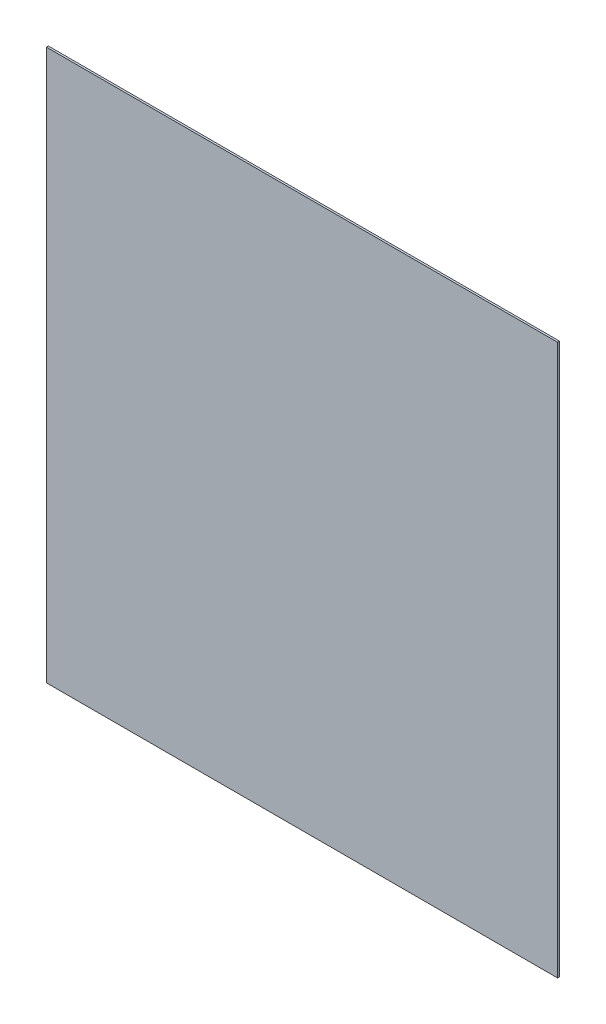
ISO-10303-21;
HEADER;
FILE_DESCRIPTION(('STEP AP214'),'2;1');
FILE_NAME('part.step','',(''),(''),'','','');
FILE_SCHEMA(('AUTOMOTIVE_DESIGN { 1 0 10303 214 1 1 1 1 }'));
ENDSEC;
DATA;
#1=APPLICATION_CONTEXT('core data for automotive mechanical design processes');
#2=APPLICATION_PROTOCOL_DEFINITION('international standard','automotive_design',2000,#1);
#3=PRODUCT_CONTEXT('',#1,'mechanical');
#4=PRODUCT('Part','Part','',(#3));
#5=PRODUCT_RELATED_PRODUCT_CATEGORY('part','',(#4));
#6=PRODUCT_DEFINITION_FORMATION('','',#4);
#7=PRODUCT_DEFINITION_CONTEXT('part definition',#1,'design');
#8=PRODUCT_DEFINITION('design','',#6,#7);
#9=PRODUCT_DEFINITION_SHAPE('','',#8);
#10=(LENGTH_UNIT() NAMED_UNIT(*) SI_UNIT(.MILLI.,.METRE.));
#11=(NAMED_UNIT(*) PLANE_ANGLE_UNIT() SI_UNIT($,.RADIAN.));
#12=(NAMED_UNIT(*) SI_UNIT($,.STERADIAN.) SOLID_ANGLE_UNIT());
#13=UNCERTAINTY_MEASURE_WITH_UNIT(LENGTH_MEASURE(1.E-05),#10,'distance_accuracy_value','');
#14=(GEOMETRIC_REPRESENTATION_CONTEXT(3) GLOBAL_UNCERTAINTY_ASSIGNED_CONTEXT((#13)) GLOBAL_UNIT_ASSIGNED_CONTEXT((#10,
#11,#12)) REPRESENTATION_CONTEXT('',''));
#15=CARTESIAN_POINT('',(0.,0.,0.));
#16=DIRECTION('',(0.,0.,1.));
#17=DIRECTION('',(1.,0.,0.));
#18=AXIS2_PLACEMENT_3D('',#15,#16,#17);
#19=CARTESIAN_POINT('',(0.,0.,0.));
#20=DIRECTION('',(0.,0.,1.));
#21=DIRECTION('',(1.,0.,0.));
#22=AXIS2_PLACEMENT_3D('',#19,#20,#21);
#23=PLANE('',#22);
#24=DIRECTION('',(0.,1.,0.));
#25=VECTOR('',#24,1.);
#26=CARTESIAN_POINT('',(65.,-70.,0.));
#27=LINE('',#26,#25);
#28=CARTESIAN_POINT('',(65.,-70.,0.));
#29=VERTEX_POINT('',#28);
#30=CARTESIAN_POINT('',(65.,70.,0.));
#31=VERTEX_POINT('',#30);
#32=EDGE_CURVE('E27',#29,#31,#27,.T.);
#33=ORIENTED_EDGE('',*,*,#32,.F.);
#34=DIRECTION('',(1.,0.,0.));
#35=VECTOR('',#34,1.);
#36=CARTESIAN_POINT('',(-65.,-70.,0.));
#37=LINE('',#36,#35);
#38=CARTESIAN_POINT('',(-65.,-70.,0.));
#39=VERTEX_POINT('',#38);
#40=EDGE_CURVE('E83',#39,#29,#37,.T.);
#41=ORIENTED_EDGE('',*,*,#40,.F.);
#42=DIRECTION('',(0.,-1.,0.));
#43=VECTOR('',#42,1.);
#44=CARTESIAN_POINT('',(-65.,70.,0.));
#45=LINE('',#44,#43);
#46=CARTESIAN_POINT('',(-65.,70.,0.));
#47=VERTEX_POINT('',#46);
#48=EDGE_CURVE('E98',#47,#39,#45,.T.);
#49=ORIENTED_EDGE('',*,*,#48,.F.);
#50=DIRECTION('',(-1.,0.,0.));
#51=VECTOR('',#50,1.);
#52=CARTESIAN_POINT('',(65.,70.,0.));
#53=LINE('',#52,#51);
#54=EDGE_CURVE('E95',#31,#47,#53,.T.);
#55=ORIENTED_EDGE('',*,*,#54,.F.);
#56=EDGE_LOOP('',(#33,#41,#49,#55));
#57=FACE_BOUND('',#56,.T.);
#58=ADVANCED_FACE('F16',(#57),#23,.F.);
#59=CARTESIAN_POINT('',(0.,0.,0.5));
#60=DIRECTION('',(0.,0.,1.));
#61=DIRECTION('',(1.,0.,0.));
#62=AXIS2_PLACEMENT_3D('',#59,#60,#61);
#63=PLANE('',#62);
#64=DIRECTION('',(0.,1.,0.));
#65=VECTOR('',#64,1.);
#66=CARTESIAN_POINT('',(65.,-70.,0.5));
#67=LINE('',#66,#65);
#68=CARTESIAN_POINT('',(65.,-70.,0.5));
#69=VERTEX_POINT('',#68);
#70=CARTESIAN_POINT('',(65.,70.,0.5));
#71=VERTEX_POINT('',#70);
#72=EDGE_CURVE('E11',#69,#71,#67,.T.);
#73=ORIENTED_EDGE('',*,*,#72,.T.);
#74=DIRECTION('',(-1.,0.,0.));
#75=VECTOR('',#74,1.);
#76=CARTESIAN_POINT('',(65.,70.,0.5));
#77=LINE('',#76,#75);
#78=CARTESIAN_POINT('',(-65.,70.,0.5));
#79=VERTEX_POINT('',#78);
#80=EDGE_CURVE('E92',#71,#79,#77,.T.);
#81=ORIENTED_EDGE('',*,*,#80,.T.);
#82=DIRECTION('',(0.,-1.,0.));
#83=VECTOR('',#82,1.);
#84=CARTESIAN_POINT('',(-65.,70.,0.5));
#85=LINE('',#84,#83);
#86=CARTESIAN_POINT('',(-65.,-70.,0.5));
#87=VERTEX_POINT('',#86);
#88=EDGE_CURVE('E74',#79,#87,#85,.T.);
#89=ORIENTED_EDGE('',*,*,#88,.T.);
#90=DIRECTION('',(1.,0.,0.));
#91=VECTOR('',#90,1.);
#92=CARTESIAN_POINT('',(-65.,-70.,0.5));
#93=LINE('',#92,#91);
#94=EDGE_CURVE('E71',#87,#69,#93,.T.);
#95=ORIENTED_EDGE('',*,*,#94,.T.);
#96=EDGE_LOOP('',(#73,#81,#89,#95));
#97=FACE_BOUND('',#96,.T.);
#98=ADVANCED_FACE('F72',(#97),#63,.T.);
#99=CARTESIAN_POINT('',(65.,-70.,0.));
#100=DIRECTION('',(1.,0.,0.));
#101=DIRECTION('',(0.,1.,0.));
#102=AXIS2_PLACEMENT_3D('',#99,#100,#101);
#103=PLANE('',#102);
#104=ORIENTED_EDGE('',*,*,#32,.T.);
#105=DIRECTION('',(0.,0.,1.));
#106=VECTOR('',#105,1.);
#107=CARTESIAN_POINT('',(65.,70.,0.));
#108=LINE('',#107,#106);
#109=EDGE_CURVE('E68',#31,#71,#108,.T.);
#110=ORIENTED_EDGE('',*,*,#109,.T.);
#111=ORIENTED_EDGE('',*,*,#72,.F.);
#112=DIRECTION('',(0.,0.,1.));
#113=VECTOR('',#112,1.);
#114=CARTESIAN_POINT('',(65.,-70.,0.));
#115=LINE('',#114,#113);
#116=EDGE_CURVE('E65',#29,#69,#115,.T.);
#117=ORIENTED_EDGE('',*,*,#116,.F.);
#118=EDGE_LOOP('',(#104,#110,#111,#117));
#119=FACE_BOUND('',#118,.T.);
#120=ADVANCED_FACE('F63',(#119),#103,.T.);
#121=CARTESIAN_POINT('',(65.,70.,0.));
#122=DIRECTION('',(0.,1.,0.));
#123=DIRECTION('',(1.,0.,0.));
#124=AXIS2_PLACEMENT_3D('',#121,#122,#123);
#125=PLANE('',#124);
#126=ORIENTED_EDGE('',*,*,#54,.T.);
#127=DIRECTION('',(0.,0.,1.));
#128=VECTOR('',#127,1.);
#129=CARTESIAN_POINT('',(-65.,70.,0.));
#130=LINE('',#129,#128);
#131=EDGE_CURVE('E20',#47,#79,#130,.T.);
#132=ORIENTED_EDGE('',*,*,#131,.T.);
#133=ORIENTED_EDGE('',*,*,#80,.F.);
#134=ORIENTED_EDGE('',*,*,#109,.F.);
#135=EDGE_LOOP('',(#126,#132,#133,#134));
#136=FACE_BOUND('',#135,.T.);
#137=ADVANCED_FACE('F113',(#136),#125,.T.);
#138=CARTESIAN_POINT('',(-65.,70.,0.));
#139=DIRECTION('',(-1.,0.,0.));
#140=DIRECTION('',(0.,0.,1.));
#141=AXIS2_PLACEMENT_3D('',#138,#139,#140);
#142=PLANE('',#141);
#143=ORIENTED_EDGE('',*,*,#48,.T.);
#144=DIRECTION('',(0.,0.,1.));
#145=VECTOR('',#144,1.);
#146=CARTESIAN_POINT('',(-65.,-70.,0.));
#147=LINE('',#146,#145);
#148=EDGE_CURVE('E79',#39,#87,#147,.T.);
#149=ORIENTED_EDGE('',*,*,#148,.T.);
#150=ORIENTED_EDGE('',*,*,#88,.F.);
#151=ORIENTED_EDGE('',*,*,#131,.F.);
#152=EDGE_LOOP('',(#143,#149,#150,#151));
#153=FACE_BOUND('',#152,.T.);
#154=ADVANCED_FACE('F18',(#153),#142,.T.);
#155=CARTESIAN_POINT('',(-65.,-70.,0.));
#156=DIRECTION('',(0.,-1.,0.));
#157=DIRECTION('',(0.,0.,-1.));
#158=AXIS2_PLACEMENT_3D('',#155,#156,#157);
#159=PLANE('',#158);
#160=ORIENTED_EDGE('',*,*,#40,.T.);
#161=ORIENTED_EDGE('',*,*,#116,.T.);
#162=ORIENTED_EDGE('',*,*,#94,.F.);
#163=ORIENTED_EDGE('',*,*,#148,.F.);
#164=EDGE_LOOP('',(#160,#161,#162,#163));
#165=FACE_BOUND('',#164,.T.);
#166=ADVANCED_FACE('F81',(#165),#159,.T.);
#167=CLOSED_SHELL('',(#58,#98,#120,#137,#154,#166));
#168=MANIFOLD_SOLID_BREP('B1',#167);
#169=ADVANCED_BREP_SHAPE_REPRESENTATION('',(#18,#168),#14);
#170=SHAPE_DEFINITION_REPRESENTATION(#9,#169);
ENDSEC;
END-ISO-10303-21;
